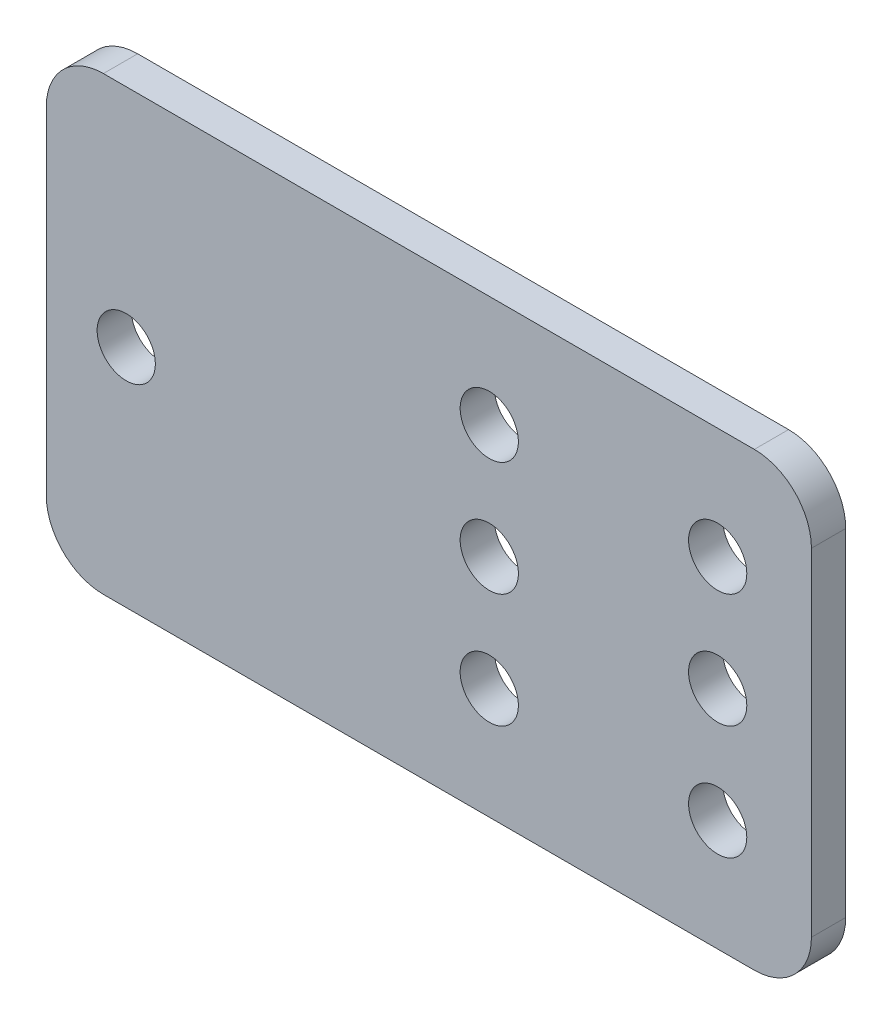
ISO-10303-21;
HEADER;
FILE_DESCRIPTION(('STEP AP214'),'2;1');
FILE_NAME('part.step','',(''),(''),'','','');
FILE_SCHEMA(('AUTOMOTIVE_DESIGN { 1 0 10303 214 1 1 1 1 }'));
ENDSEC;
DATA;
#1=APPLICATION_CONTEXT('core data for automotive mechanical design processes');
#2=APPLICATION_PROTOCOL_DEFINITION('international standard','automotive_design',2000,#1);
#3=PRODUCT_CONTEXT('',#1,'mechanical');
#4=PRODUCT('Part','Part','',(#3));
#5=PRODUCT_RELATED_PRODUCT_CATEGORY('part','',(#4));
#6=PRODUCT_DEFINITION_FORMATION('','',#4);
#7=PRODUCT_DEFINITION_CONTEXT('part definition',#1,'design');
#8=PRODUCT_DEFINITION('design','',#6,#7);
#9=PRODUCT_DEFINITION_SHAPE('','',#8);
#10=(LENGTH_UNIT() NAMED_UNIT(*) SI_UNIT(.MILLI.,.METRE.));
#11=(NAMED_UNIT(*) PLANE_ANGLE_UNIT() SI_UNIT($,.RADIAN.));
#12=(NAMED_UNIT(*) SI_UNIT($,.STERADIAN.) SOLID_ANGLE_UNIT());
#13=UNCERTAINTY_MEASURE_WITH_UNIT(LENGTH_MEASURE(1.E-05),#10,'distance_accuracy_value','');
#14=(GEOMETRIC_REPRESENTATION_CONTEXT(3) GLOBAL_UNCERTAINTY_ASSIGNED_CONTEXT((#13)) GLOBAL_UNIT_ASSIGNED_CONTEXT((#10,
#11,#12)) REPRESENTATION_CONTEXT('',''));
#15=CARTESIAN_POINT('',(0.,0.,0.));
#16=DIRECTION('',(0.,0.,1.));
#17=DIRECTION('',(1.,0.,0.));
#18=AXIS2_PLACEMENT_3D('',#15,#16,#17);
#19=CARTESIAN_POINT('',(-28.5,-14.75,1.5));
#20=DIRECTION('',(0.,0.,-1.));
#21=DIRECTION('',(-1.,0.,0.));
#22=AXIS2_PLACEMENT_3D('',#19,#20,#21);
#23=PLANE('',#22);
#24=CARTESIAN_POINT('',(5.29000000000021,-10.,1.5));
#25=DIRECTION('',(0.,0.,1.));
#26=DIRECTION('',(1.,0.,0.));
#27=AXIS2_PLACEMENT_3D('',#24,#25,#26);
#28=CIRCLE('',#27,2.55);
#29=CARTESIAN_POINT('',(7.84000000000021,-10.,1.5));
#30=VERTEX_POINT('',#29);
#31=EDGE_CURVE('E205',#30,#30,#28,.T.);
#32=ORIENTED_EDGE('',*,*,#31,.F.);
#33=EDGE_LOOP('',(#32));
#34=FACE_BOUND('',#33,.T.);
#35=CARTESIAN_POINT('',(5.29,0.,1.5));
#36=DIRECTION('',(0.,0.,1.));
#37=DIRECTION('',(1.,0.,0.));
#38=AXIS2_PLACEMENT_3D('',#35,#36,#37);
#39=CIRCLE('',#38,2.5500000000001);
#40=CARTESIAN_POINT('',(7.8400000000001,0.,1.5));
#41=VERTEX_POINT('',#40);
#42=EDGE_CURVE('E193',#41,#41,#39,.T.);
#43=ORIENTED_EDGE('',*,*,#42,.F.);
#44=EDGE_LOOP('',(#43));
#45=FACE_BOUND('',#44,.T.);
#46=CARTESIAN_POINT('',(-26.5,0.,1.5));
#47=DIRECTION('',(0.,0.,1.));
#48=DIRECTION('',(1.,0.,0.));
#49=AXIS2_PLACEMENT_3D('',#46,#47,#48);
#50=CIRCLE('',#49,2.55);
#51=CARTESIAN_POINT('',(-23.95,0.,1.5));
#52=VERTEX_POINT('',#51);
#53=EDGE_CURVE('E181',#52,#52,#50,.T.);
#54=ORIENTED_EDGE('',*,*,#53,.F.);
#55=EDGE_LOOP('',(#54));
#56=FACE_BOUND('',#55,.T.);
#57=CARTESIAN_POINT('',(-28.5,-14.75,1.5));
#58=DIRECTION('',(0.,0.,1.));
#59=DIRECTION('',(-1.,0.,0.));
#60=AXIS2_PLACEMENT_3D('',#57,#58,#59);
#61=CIRCLE('',#60,5.);
#62=CARTESIAN_POINT('',(-33.5,-14.75,1.5));
#63=VERTEX_POINT('',#62);
#64=CARTESIAN_POINT('',(-28.5,-19.75,1.5));
#65=VERTEX_POINT('',#64);
#66=EDGE_CURVE('E144',#63,#65,#61,.T.);
#67=ORIENTED_EDGE('',*,*,#66,.T.);
#68=DIRECTION('',(1.,0.,0.));
#69=VECTOR('',#68,1.);
#70=CARTESIAN_POINT('',(-28.5,-19.75,1.5));
#71=LINE('',#70,#69);
#72=CARTESIAN_POINT('',(28.5,-19.75,1.5));
#73=VERTEX_POINT('',#72);
#74=EDGE_CURVE('E92',#65,#73,#71,.T.);
#75=ORIENTED_EDGE('',*,*,#74,.T.);
#76=CARTESIAN_POINT('',(28.5,-14.75,1.5));
#77=DIRECTION('',(0.,0.,1.));
#78=DIRECTION('',(1.,0.,0.));
#79=AXIS2_PLACEMENT_3D('',#76,#77,#78);
#80=CIRCLE('',#79,5.);
#81=CARTESIAN_POINT('',(33.5,-14.75,1.5));
#82=VERTEX_POINT('',#81);
#83=EDGE_CURVE('E159',#73,#82,#80,.T.);
#84=ORIENTED_EDGE('',*,*,#83,.T.);
#85=DIRECTION('',(0.,1.,0.));
#86=VECTOR('',#85,1.);
#87=CARTESIAN_POINT('',(33.5,-14.75,1.5));
#88=LINE('',#87,#86);
#89=CARTESIAN_POINT('',(33.5,14.75,1.5));
#90=VERTEX_POINT('',#89);
#91=EDGE_CURVE('E172',#82,#90,#88,.T.);
#92=ORIENTED_EDGE('',*,*,#91,.T.);
#93=CARTESIAN_POINT('',(28.5,14.75,1.5));
#94=DIRECTION('',(0.,0.,1.));
#95=DIRECTION('',(-1.,0.,0.));
#96=AXIS2_PLACEMENT_3D('',#93,#94,#95);
#97=CIRCLE('',#96,5.);
#98=CARTESIAN_POINT('',(28.5,19.75,1.5));
#99=VERTEX_POINT('',#98);
#100=EDGE_CURVE('E111',#90,#99,#97,.T.);
#101=ORIENTED_EDGE('',*,*,#100,.T.);
#102=DIRECTION('',(-1.,0.,0.));
#103=VECTOR('',#102,1.);
#104=CARTESIAN_POINT('',(-28.5,19.75,1.5));
#105=LINE('',#104,#103);
#106=CARTESIAN_POINT('',(-28.5,19.75,1.5));
#107=VERTEX_POINT('',#106);
#108=EDGE_CURVE('E105',#99,#107,#105,.T.);
#109=ORIENTED_EDGE('',*,*,#108,.T.);
#110=CARTESIAN_POINT('',(-28.5,14.75,1.5));
#111=DIRECTION('',(0.,0.,1.));
#112=DIRECTION('',(-1.,0.,0.));
#113=AXIS2_PLACEMENT_3D('',#110,#111,#112);
#114=CIRCLE('',#113,5.);
#115=CARTESIAN_POINT('',(-33.5,14.75,1.5));
#116=VERTEX_POINT('',#115);
#117=EDGE_CURVE('E109',#107,#116,#114,.T.);
#118=ORIENTED_EDGE('',*,*,#117,.T.);
#119=DIRECTION('',(0.,-1.,0.));
#120=VECTOR('',#119,1.);
#121=CARTESIAN_POINT('',(-33.5,-14.75,1.5));
#122=LINE('',#121,#120);
#123=EDGE_CURVE('E49',#116,#63,#122,.T.);
#124=ORIENTED_EDGE('',*,*,#123,.T.);
#125=EDGE_LOOP('',(#67,#75,#84,#92,#101,#109,#118,#124));
#126=FACE_BOUND('',#125,.T.);
#127=CARTESIAN_POINT('',(5.29,10.,1.5));
#128=DIRECTION('',(0.,0.,1.));
#129=DIRECTION('',(1.,0.,0.));
#130=AXIS2_PLACEMENT_3D('',#127,#128,#129);
#131=CIRCLE('',#130,2.55);
#132=CARTESIAN_POINT('',(7.84,10.,1.5));
#133=VERTEX_POINT('',#132);
#134=EDGE_CURVE('E133',#133,#133,#131,.T.);
#135=ORIENTED_EDGE('',*,*,#134,.F.);
#136=EDGE_LOOP('',(#135));
#137=FACE_BOUND('',#136,.T.);
#138=CARTESIAN_POINT('',(25.29,10.,1.5));
#139=DIRECTION('',(0.,0.,1.));
#140=DIRECTION('',(1.,0.,0.));
#141=AXIS2_PLACEMENT_3D('',#138,#139,#140);
#142=CIRCLE('',#141,2.55);
#143=CARTESIAN_POINT('',(27.84,10.,1.5));
#144=VERTEX_POINT('',#143);
#145=EDGE_CURVE('E187',#144,#144,#142,.T.);
#146=ORIENTED_EDGE('',*,*,#145,.F.);
#147=EDGE_LOOP('',(#146));
#148=FACE_BOUND('',#147,.T.);
#149=CARTESIAN_POINT('',(25.2900000000001,0.,1.5));
#150=DIRECTION('',(0.,0.,1.));
#151=DIRECTION('',(1.,0.,0.));
#152=AXIS2_PLACEMENT_3D('',#149,#150,#151);
#153=CIRCLE('',#152,2.55);
#154=CARTESIAN_POINT('',(27.8400000000001,0.,1.5));
#155=VERTEX_POINT('',#154);
#156=EDGE_CURVE('E199',#155,#155,#153,.T.);
#157=ORIENTED_EDGE('',*,*,#156,.F.);
#158=EDGE_LOOP('',(#157));
#159=FACE_BOUND('',#158,.T.);
#160=CARTESIAN_POINT('',(25.2900000000002,-10.,1.5));
#161=DIRECTION('',(0.,0.,1.));
#162=DIRECTION('',(1.,0.,0.));
#163=AXIS2_PLACEMENT_3D('',#160,#161,#162);
#164=CIRCLE('',#163,2.55);
#165=CARTESIAN_POINT('',(27.8400000000002,-10.,1.5));
#166=VERTEX_POINT('',#165);
#167=EDGE_CURVE('E211',#166,#166,#164,.T.);
#168=ORIENTED_EDGE('',*,*,#167,.F.);
#169=EDGE_LOOP('',(#168));
#170=FACE_BOUND('',#169,.T.);
#171=ADVANCED_FACE('F32',(#34,#45,#56,#126,#137,#148,#159,#170),#23,.F.);
#172=CARTESIAN_POINT('',(-28.5,-14.75,-1.5));
#173=DIRECTION('',(0.,0.,-1.));
#174=DIRECTION('',(-1.,0.,0.));
#175=AXIS2_PLACEMENT_3D('',#172,#173,#174);
#176=PLANE('',#175);
#177=CARTESIAN_POINT('',(5.29000000000021,-10.,-1.5));
#178=DIRECTION('',(0.,0.,1.));
#179=DIRECTION('',(1.,0.,0.));
#180=AXIS2_PLACEMENT_3D('',#177,#178,#179);
#181=CIRCLE('',#180,2.55);
#182=CARTESIAN_POINT('',(7.84000000000021,-10.,-1.5));
#183=VERTEX_POINT('',#182);
#184=EDGE_CURVE('E208',#183,#183,#181,.T.);
#185=ORIENTED_EDGE('',*,*,#184,.T.);
#186=EDGE_LOOP('',(#185));
#187=FACE_BOUND('',#186,.T.);
#188=CARTESIAN_POINT('',(5.29,0.,-1.5));
#189=DIRECTION('',(0.,0.,1.));
#190=DIRECTION('',(1.,0.,0.));
#191=AXIS2_PLACEMENT_3D('',#188,#189,#190);
#192=CIRCLE('',#191,2.5500000000001);
#193=CARTESIAN_POINT('',(7.8400000000001,0.,-1.5));
#194=VERTEX_POINT('',#193);
#195=EDGE_CURVE('E196',#194,#194,#192,.T.);
#196=ORIENTED_EDGE('',*,*,#195,.T.);
#197=EDGE_LOOP('',(#196));
#198=FACE_BOUND('',#197,.T.);
#199=CARTESIAN_POINT('',(-26.5,0.,-1.5));
#200=DIRECTION('',(0.,0.,1.));
#201=DIRECTION('',(1.,0.,0.));
#202=AXIS2_PLACEMENT_3D('',#199,#200,#201);
#203=CIRCLE('',#202,2.55);
#204=CARTESIAN_POINT('',(-23.95,0.,-1.5));
#205=VERTEX_POINT('',#204);
#206=EDGE_CURVE('E184',#205,#205,#203,.T.);
#207=ORIENTED_EDGE('',*,*,#206,.T.);
#208=EDGE_LOOP('',(#207));
#209=FACE_BOUND('',#208,.T.);
#210=CARTESIAN_POINT('',(-28.5,-14.75,-1.5));
#211=DIRECTION('',(0.,0.,1.));
#212=DIRECTION('',(-1.,0.,0.));
#213=AXIS2_PLACEMENT_3D('',#210,#211,#212);
#214=CIRCLE('',#213,5.);
#215=CARTESIAN_POINT('',(-33.5,-14.75,-1.5));
#216=VERTEX_POINT('',#215);
#217=CARTESIAN_POINT('',(-28.5,-19.75,-1.5));
#218=VERTEX_POINT('',#217);
#219=EDGE_CURVE('E129',#216,#218,#214,.T.);
#220=ORIENTED_EDGE('',*,*,#219,.F.);
#221=DIRECTION('',(0.,-1.,0.));
#222=VECTOR('',#221,1.);
#223=CARTESIAN_POINT('',(-33.5,-14.75,-1.5));
#224=LINE('',#223,#222);
#225=CARTESIAN_POINT('',(-33.5,14.75,-1.5));
#226=VERTEX_POINT('',#225);
#227=EDGE_CURVE('E84',#226,#216,#224,.T.);
#228=ORIENTED_EDGE('',*,*,#227,.F.);
#229=CARTESIAN_POINT('',(-28.5,14.75,-1.5));
#230=DIRECTION('',(0.,0.,1.));
#231=DIRECTION('',(-1.,0.,0.));
#232=AXIS2_PLACEMENT_3D('',#229,#230,#231);
#233=CIRCLE('',#232,5.);
#234=CARTESIAN_POINT('',(-28.5,19.75,-1.5));
#235=VERTEX_POINT('',#234);
#236=EDGE_CURVE('E78',#235,#226,#233,.T.);
#237=ORIENTED_EDGE('',*,*,#236,.F.);
#238=DIRECTION('',(-1.,0.,0.));
#239=VECTOR('',#238,1.);
#240=CARTESIAN_POINT('',(-28.5,19.75,-1.5));
#241=LINE('',#240,#239);
#242=CARTESIAN_POINT('',(28.5,19.75,-1.5));
#243=VERTEX_POINT('',#242);
#244=EDGE_CURVE('E119',#243,#235,#241,.T.);
#245=ORIENTED_EDGE('',*,*,#244,.F.);
#246=CARTESIAN_POINT('',(28.5,14.75,-1.5));
#247=DIRECTION('',(0.,0.,1.));
#248=DIRECTION('',(-1.,0.,0.));
#249=AXIS2_PLACEMENT_3D('',#246,#247,#248);
#250=CIRCLE('',#249,5.);
#251=CARTESIAN_POINT('',(33.5,14.75,-1.5));
#252=VERTEX_POINT('',#251);
#253=EDGE_CURVE('E139',#252,#243,#250,.T.);
#254=ORIENTED_EDGE('',*,*,#253,.F.);
#255=DIRECTION('',(0.,1.,0.));
#256=VECTOR('',#255,1.);
#257=CARTESIAN_POINT('',(33.5,-14.75,-1.5));
#258=LINE('',#257,#256);
#259=CARTESIAN_POINT('',(33.5,-14.75,-1.5));
#260=VERTEX_POINT('',#259);
#261=EDGE_CURVE('E137',#260,#252,#258,.T.);
#262=ORIENTED_EDGE('',*,*,#261,.F.);
#263=CARTESIAN_POINT('',(28.5,-14.75,-1.5));
#264=DIRECTION('',(0.,0.,1.));
#265=DIRECTION('',(1.,0.,0.));
#266=AXIS2_PLACEMENT_3D('',#263,#264,#265);
#267=CIRCLE('',#266,5.);
#268=CARTESIAN_POINT('',(28.5,-19.75,-1.5));
#269=VERTEX_POINT('',#268);
#270=EDGE_CURVE('E135',#269,#260,#267,.T.);
#271=ORIENTED_EDGE('',*,*,#270,.F.);
#272=DIRECTION('',(1.,0.,0.));
#273=VECTOR('',#272,1.);
#274=CARTESIAN_POINT('',(-28.5,-19.75,-1.5));
#275=LINE('',#274,#273);
#276=EDGE_CURVE('E132',#218,#269,#275,.T.);
#277=ORIENTED_EDGE('',*,*,#276,.F.);
#278=EDGE_LOOP('',(#220,#228,#237,#245,#254,#262,#271,#277));
#279=FACE_BOUND('',#278,.T.);
#280=CARTESIAN_POINT('',(5.29,10.,-1.5));
#281=DIRECTION('',(0.,0.,1.));
#282=DIRECTION('',(1.,0.,0.));
#283=AXIS2_PLACEMENT_3D('',#280,#281,#282);
#284=CIRCLE('',#283,2.55);
#285=CARTESIAN_POINT('',(7.84,10.,-1.5));
#286=VERTEX_POINT('',#285);
#287=EDGE_CURVE('E178',#286,#286,#284,.T.);
#288=ORIENTED_EDGE('',*,*,#287,.T.);
#289=EDGE_LOOP('',(#288));
#290=FACE_BOUND('',#289,.T.);
#291=CARTESIAN_POINT('',(25.29,10.,-1.5));
#292=DIRECTION('',(0.,0.,1.));
#293=DIRECTION('',(1.,0.,0.));
#294=AXIS2_PLACEMENT_3D('',#291,#292,#293);
#295=CIRCLE('',#294,2.55);
#296=CARTESIAN_POINT('',(27.84,10.,-1.5));
#297=VERTEX_POINT('',#296);
#298=EDGE_CURVE('E190',#297,#297,#295,.T.);
#299=ORIENTED_EDGE('',*,*,#298,.T.);
#300=EDGE_LOOP('',(#299));
#301=FACE_BOUND('',#300,.T.);
#302=CARTESIAN_POINT('',(25.2900000000001,0.,-1.5));
#303=DIRECTION('',(0.,0.,1.));
#304=DIRECTION('',(1.,0.,0.));
#305=AXIS2_PLACEMENT_3D('',#302,#303,#304);
#306=CIRCLE('',#305,2.55);
#307=CARTESIAN_POINT('',(27.8400000000001,0.,-1.5));
#308=VERTEX_POINT('',#307);
#309=EDGE_CURVE('E202',#308,#308,#306,.T.);
#310=ORIENTED_EDGE('',*,*,#309,.T.);
#311=EDGE_LOOP('',(#310));
#312=FACE_BOUND('',#311,.T.);
#313=CARTESIAN_POINT('',(25.2900000000002,-10.,-1.5));
#314=DIRECTION('',(0.,0.,1.));
#315=DIRECTION('',(1.,0.,0.));
#316=AXIS2_PLACEMENT_3D('',#313,#314,#315);
#317=CIRCLE('',#316,2.55);
#318=CARTESIAN_POINT('',(27.8400000000002,-10.,-1.5));
#319=VERTEX_POINT('',#318);
#320=EDGE_CURVE('E214',#319,#319,#317,.T.);
#321=ORIENTED_EDGE('',*,*,#320,.T.);
#322=EDGE_LOOP('',(#321));
#323=FACE_BOUND('',#322,.T.);
#324=ADVANCED_FACE('F163',(#187,#198,#209,#279,#290,#301,#312,#323),#176,.T.);
#325=CARTESIAN_POINT('',(-28.5,-14.75,1.5));
#326=DIRECTION('',(0.,0.,-1.));
#327=DIRECTION('',(-1.,0.,0.));
#328=AXIS2_PLACEMENT_3D('',#325,#326,#327);
#329=CYLINDRICAL_SURFACE('',#328,5.);
#330=ORIENTED_EDGE('',*,*,#219,.T.);
#331=DIRECTION('',(0.,0.,-1.));
#332=VECTOR('',#331,1.);
#333=CARTESIAN_POINT('',(-28.5,-19.75,1.5));
#334=LINE('',#333,#332);
#335=EDGE_CURVE('E11',#65,#218,#334,.T.);
#336=ORIENTED_EDGE('',*,*,#335,.F.);
#337=ORIENTED_EDGE('',*,*,#66,.F.);
#338=DIRECTION('',(0.,0.,-1.));
#339=VECTOR('',#338,1.);
#340=CARTESIAN_POINT('',(-33.5,-14.75,1.5));
#341=LINE('',#340,#339);
#342=EDGE_CURVE('E125',#63,#216,#341,.T.);
#343=ORIENTED_EDGE('',*,*,#342,.T.);
#344=EDGE_LOOP('',(#330,#336,#337,#343));
#345=FACE_BOUND('',#344,.T.);
#346=ADVANCED_FACE('F34',(#345),#329,.T.);
#347=CARTESIAN_POINT('',(-28.5,-19.75,1.5));
#348=DIRECTION('',(0.,1.,0.));
#349=DIRECTION('',(0.,0.,1.));
#350=AXIS2_PLACEMENT_3D('',#347,#348,#349);
#351=PLANE('',#350);
#352=ORIENTED_EDGE('',*,*,#276,.T.);
#353=DIRECTION('',(0.,0.,-1.));
#354=VECTOR('',#353,1.);
#355=CARTESIAN_POINT('',(28.5,-19.75,1.5));
#356=LINE('',#355,#354);
#357=EDGE_CURVE('E41',#73,#269,#356,.T.);
#358=ORIENTED_EDGE('',*,*,#357,.F.);
#359=ORIENTED_EDGE('',*,*,#74,.F.);
#360=ORIENTED_EDGE('',*,*,#335,.T.);
#361=EDGE_LOOP('',(#352,#358,#359,#360));
#362=FACE_BOUND('',#361,.T.);
#363=ADVANCED_FACE('F249',(#362),#351,.F.);
#364=CARTESIAN_POINT('',(28.5,-14.75,1.5));
#365=DIRECTION('',(0.,0.,-1.));
#366=DIRECTION('',(-1.,0.,0.));
#367=AXIS2_PLACEMENT_3D('',#364,#365,#366);
#368=CYLINDRICAL_SURFACE('',#367,5.);
#369=ORIENTED_EDGE('',*,*,#270,.T.);
#370=DIRECTION('',(0.,0.,-1.));
#371=VECTOR('',#370,1.);
#372=CARTESIAN_POINT('',(33.5,-14.75,1.5));
#373=LINE('',#372,#371);
#374=EDGE_CURVE('E151',#82,#260,#373,.T.);
#375=ORIENTED_EDGE('',*,*,#374,.F.);
#376=ORIENTED_EDGE('',*,*,#83,.F.);
#377=ORIENTED_EDGE('',*,*,#357,.T.);
#378=EDGE_LOOP('',(#369,#375,#376,#377));
#379=FACE_BOUND('',#378,.T.);
#380=ADVANCED_FACE('F157',(#379),#368,.T.);
#381=CARTESIAN_POINT('',(33.5,-14.75,1.5));
#382=DIRECTION('',(-1.,0.,0.));
#383=DIRECTION('',(0.,0.,1.));
#384=AXIS2_PLACEMENT_3D('',#381,#382,#383);
#385=PLANE('',#384);
#386=ORIENTED_EDGE('',*,*,#261,.T.);
#387=DIRECTION('',(0.,0.,-1.));
#388=VECTOR('',#387,1.);
#389=CARTESIAN_POINT('',(33.5,14.75,1.5));
#390=LINE('',#389,#388);
#391=EDGE_CURVE('E148',#90,#252,#390,.T.);
#392=ORIENTED_EDGE('',*,*,#391,.F.);
#393=ORIENTED_EDGE('',*,*,#91,.F.);
#394=ORIENTED_EDGE('',*,*,#374,.T.);
#395=EDGE_LOOP('',(#386,#392,#393,#394));
#396=FACE_BOUND('',#395,.T.);
#397=ADVANCED_FACE('F168',(#396),#385,.F.);
#398=CARTESIAN_POINT('',(28.5,14.75,1.5));
#399=DIRECTION('',(0.,0.,-1.));
#400=DIRECTION('',(-1.,0.,0.));
#401=AXIS2_PLACEMENT_3D('',#398,#399,#400);
#402=CYLINDRICAL_SURFACE('',#401,5.);
#403=ORIENTED_EDGE('',*,*,#253,.T.);
#404=DIRECTION('',(0.,0.,-1.));
#405=VECTOR('',#404,1.);
#406=CARTESIAN_POINT('',(28.5,19.75,1.5));
#407=LINE('',#406,#405);
#408=EDGE_CURVE('E120',#99,#243,#407,.T.);
#409=ORIENTED_EDGE('',*,*,#408,.F.);
#410=ORIENTED_EDGE('',*,*,#100,.F.);
#411=ORIENTED_EDGE('',*,*,#391,.T.);
#412=EDGE_LOOP('',(#403,#409,#410,#411));
#413=FACE_BOUND('',#412,.T.);
#414=ADVANCED_FACE('F171',(#413),#402,.T.);
#415=CARTESIAN_POINT('',(-28.5,19.75,1.5));
#416=DIRECTION('',(0.,-1.,0.));
#417=DIRECTION('',(0.,0.,-1.));
#418=AXIS2_PLACEMENT_3D('',#415,#416,#417);
#419=PLANE('',#418);
#420=ORIENTED_EDGE('',*,*,#244,.T.);
#421=DIRECTION('',(0.,0.,-1.));
#422=VECTOR('',#421,1.);
#423=CARTESIAN_POINT('',(-28.5,19.75,1.5));
#424=LINE('',#423,#422);
#425=EDGE_CURVE('E116',#107,#235,#424,.T.);
#426=ORIENTED_EDGE('',*,*,#425,.F.);
#427=ORIENTED_EDGE('',*,*,#108,.F.);
#428=ORIENTED_EDGE('',*,*,#408,.T.);
#429=EDGE_LOOP('',(#420,#426,#427,#428));
#430=FACE_BOUND('',#429,.T.);
#431=ADVANCED_FACE('F117',(#430),#419,.F.);
#432=CARTESIAN_POINT('',(-28.5,14.75,1.5));
#433=DIRECTION('',(0.,0.,-1.));
#434=DIRECTION('',(-1.,0.,0.));
#435=AXIS2_PLACEMENT_3D('',#432,#433,#434);
#436=CYLINDRICAL_SURFACE('',#435,5.);
#437=ORIENTED_EDGE('',*,*,#236,.T.);
#438=DIRECTION('',(0.,0.,-1.));
#439=VECTOR('',#438,1.);
#440=CARTESIAN_POINT('',(-33.5,14.75,1.5));
#441=LINE('',#440,#439);
#442=EDGE_CURVE('E121',#116,#226,#441,.T.);
#443=ORIENTED_EDGE('',*,*,#442,.F.);
#444=ORIENTED_EDGE('',*,*,#117,.F.);
#445=ORIENTED_EDGE('',*,*,#425,.T.);
#446=EDGE_LOOP('',(#437,#443,#444,#445));
#447=FACE_BOUND('',#446,.T.);
#448=ADVANCED_FACE('F123',(#447),#436,.T.);
#449=CARTESIAN_POINT('',(-33.5,-14.75,1.5));
#450=DIRECTION('',(1.,0.,0.));
#451=DIRECTION('',(0.,0.,-1.));
#452=AXIS2_PLACEMENT_3D('',#449,#450,#451);
#453=PLANE('',#452);
#454=ORIENTED_EDGE('',*,*,#227,.T.);
#455=ORIENTED_EDGE('',*,*,#342,.F.);
#456=ORIENTED_EDGE('',*,*,#123,.F.);
#457=ORIENTED_EDGE('',*,*,#442,.T.);
#458=EDGE_LOOP('',(#454,#455,#456,#457));
#459=FACE_BOUND('',#458,.T.);
#460=ADVANCED_FACE('F237',(#459),#453,.F.);
#461=CARTESIAN_POINT('',(5.29,10.,1.5));
#462=DIRECTION('',(0.,0.,-1.));
#463=DIRECTION('',(-1.,0.,0.));
#464=AXIS2_PLACEMENT_3D('',#461,#462,#463);
#465=CYLINDRICAL_SURFACE('',#464,2.55);
#466=ORIENTED_EDGE('',*,*,#134,.T.);
#467=EDGE_LOOP('',(#466));
#468=FACE_BOUND('',#467,.T.);
#469=ORIENTED_EDGE('',*,*,#287,.F.);
#470=EDGE_LOOP('',(#469));
#471=FACE_BOUND('',#470,.T.);
#472=ADVANCED_FACE('F234',(#468,#471),#465,.F.);
#473=CARTESIAN_POINT('',(-26.5,0.,1.5));
#474=DIRECTION('',(0.,0.,-1.));
#475=DIRECTION('',(-1.,0.,0.));
#476=AXIS2_PLACEMENT_3D('',#473,#474,#475);
#477=CYLINDRICAL_SURFACE('',#476,2.55);
#478=ORIENTED_EDGE('',*,*,#53,.T.);
#479=EDGE_LOOP('',(#478));
#480=FACE_BOUND('',#479,.T.);
#481=ORIENTED_EDGE('',*,*,#206,.F.);
#482=EDGE_LOOP('',(#481));
#483=FACE_BOUND('',#482,.T.);
#484=ADVANCED_FACE('F313',(#480,#483),#477,.F.);
#485=CARTESIAN_POINT('',(25.29,10.,1.5));
#486=DIRECTION('',(0.,0.,-1.));
#487=DIRECTION('',(-1.,0.,0.));
#488=AXIS2_PLACEMENT_3D('',#485,#486,#487);
#489=CYLINDRICAL_SURFACE('',#488,2.55);
#490=ORIENTED_EDGE('',*,*,#145,.T.);
#491=EDGE_LOOP('',(#490));
#492=FACE_BOUND('',#491,.T.);
#493=ORIENTED_EDGE('',*,*,#298,.F.);
#494=EDGE_LOOP('',(#493));
#495=FACE_BOUND('',#494,.T.);
#496=ADVANCED_FACE('F321',(#492,#495),#489,.F.);
#497=CARTESIAN_POINT('',(5.29,0.,1.5));
#498=DIRECTION('',(0.,0.,-1.));
#499=DIRECTION('',(-1.,0.,0.));
#500=AXIS2_PLACEMENT_3D('',#497,#498,#499);
#501=CYLINDRICAL_SURFACE('',#500,2.5500000000001);
#502=ORIENTED_EDGE('',*,*,#42,.T.);
#503=EDGE_LOOP('',(#502));
#504=FACE_BOUND('',#503,.T.);
#505=ORIENTED_EDGE('',*,*,#195,.F.);
#506=EDGE_LOOP('',(#505));
#507=FACE_BOUND('',#506,.T.);
#508=ADVANCED_FACE('F329',(#504,#507),#501,.F.);
#509=CARTESIAN_POINT('',(25.2900000000001,0.,1.5));
#510=DIRECTION('',(0.,0.,-1.));
#511=DIRECTION('',(-1.,0.,0.));
#512=AXIS2_PLACEMENT_3D('',#509,#510,#511);
#513=CYLINDRICAL_SURFACE('',#512,2.55);
#514=ORIENTED_EDGE('',*,*,#156,.T.);
#515=EDGE_LOOP('',(#514));
#516=FACE_BOUND('',#515,.T.);
#517=ORIENTED_EDGE('',*,*,#309,.F.);
#518=EDGE_LOOP('',(#517));
#519=FACE_BOUND('',#518,.T.);
#520=ADVANCED_FACE('F338',(#516,#519),#513,.F.);
#521=CARTESIAN_POINT('',(5.29000000000021,-10.,1.5));
#522=DIRECTION('',(0.,0.,-1.));
#523=DIRECTION('',(-1.,0.,0.));
#524=AXIS2_PLACEMENT_3D('',#521,#522,#523);
#525=CYLINDRICAL_SURFACE('',#524,2.55);
#526=ORIENTED_EDGE('',*,*,#31,.T.);
#527=EDGE_LOOP('',(#526));
#528=FACE_BOUND('',#527,.T.);
#529=ORIENTED_EDGE('',*,*,#184,.F.);
#530=EDGE_LOOP('',(#529));
#531=FACE_BOUND('',#530,.T.);
#532=ADVANCED_FACE('F347',(#528,#531),#525,.F.);
#533=CARTESIAN_POINT('',(25.2900000000002,-10.,1.5));
#534=DIRECTION('',(0.,0.,-1.));
#535=DIRECTION('',(-1.,0.,0.));
#536=AXIS2_PLACEMENT_3D('',#533,#534,#535);
#537=CYLINDRICAL_SURFACE('',#536,2.55);
#538=ORIENTED_EDGE('',*,*,#167,.T.);
#539=EDGE_LOOP('',(#538));
#540=FACE_BOUND('',#539,.T.);
#541=ORIENTED_EDGE('',*,*,#320,.F.);
#542=EDGE_LOOP('',(#541));
#543=FACE_BOUND('',#542,.T.);
#544=ADVANCED_FACE('F220',(#540,#543),#537,.F.);
#545=CLOSED_SHELL('',(#171,#324,#346,#363,#380,#397,#414,#431,#448,#460,#472,#484,#496,#508,
#520,#532,#544));
#546=MANIFOLD_SOLID_BREP('B2',#545);
#547=ADVANCED_BREP_SHAPE_REPRESENTATION('',(#18,#546),#14);
#548=SHAPE_DEFINITION_REPRESENTATION(#9,#547);
ENDSEC;
END-ISO-10303-21;
